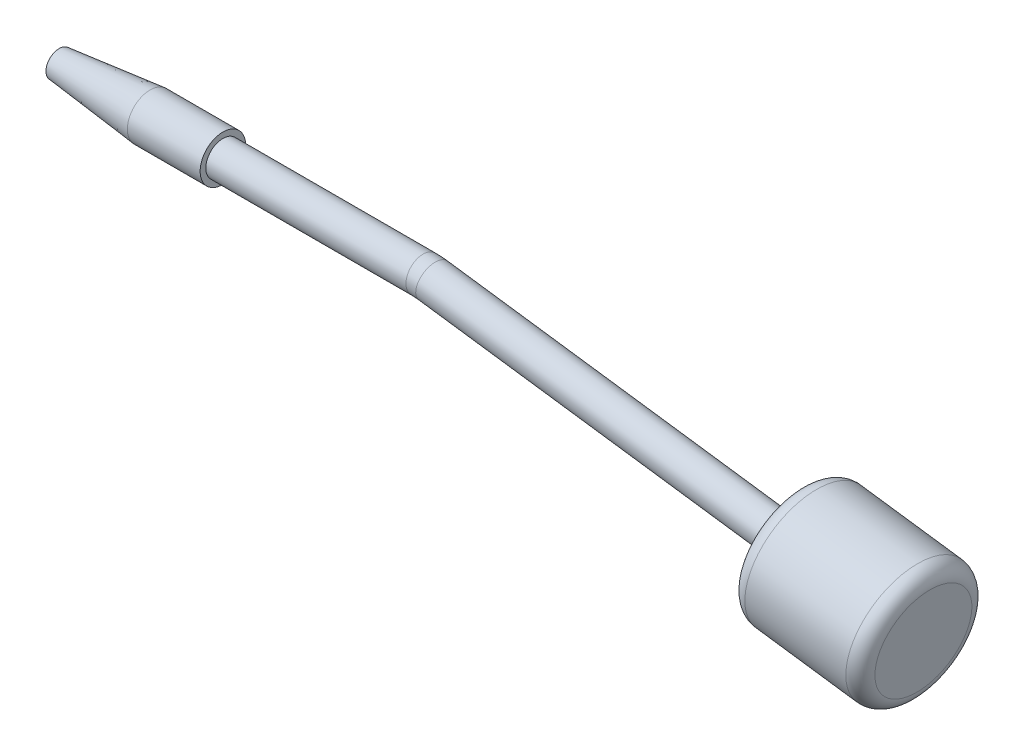
ISO-10303-21;
HEADER;
FILE_DESCRIPTION(('STEP AP214'),'2;1');
FILE_NAME('part.step','',(''),(''),'','','');
FILE_SCHEMA(('AUTOMOTIVE_DESIGN { 1 0 10303 214 1 1 1 1 }'));
ENDSEC;
DATA;
#1=APPLICATION_CONTEXT('core data for automotive mechanical design processes');
#2=APPLICATION_PROTOCOL_DEFINITION('international standard','automotive_design',2000,#1);
#3=PRODUCT_CONTEXT('',#1,'mechanical');
#4=PRODUCT('Part','Part','',(#3));
#5=PRODUCT_RELATED_PRODUCT_CATEGORY('part','',(#4));
#6=PRODUCT_DEFINITION_FORMATION('','',#4);
#7=PRODUCT_DEFINITION_CONTEXT('part definition',#1,'design');
#8=PRODUCT_DEFINITION('design','',#6,#7);
#9=PRODUCT_DEFINITION_SHAPE('','',#8);
#10=(LENGTH_UNIT() NAMED_UNIT(*) SI_UNIT(.MILLI.,.METRE.));
#11=(NAMED_UNIT(*) PLANE_ANGLE_UNIT() SI_UNIT($,.RADIAN.));
#12=(NAMED_UNIT(*) SI_UNIT($,.STERADIAN.) SOLID_ANGLE_UNIT());
#13=UNCERTAINTY_MEASURE_WITH_UNIT(LENGTH_MEASURE(1.E-05),#10,'distance_accuracy_value','');
#14=(GEOMETRIC_REPRESENTATION_CONTEXT(3) GLOBAL_UNCERTAINTY_ASSIGNED_CONTEXT((#13)) GLOBAL_UNIT_ASSIGNED_CONTEXT((#10,
#11,#12)) REPRESENTATION_CONTEXT('',''));
#15=CARTESIAN_POINT('',(0.,0.,0.));
#16=DIRECTION('',(0.,0.,1.));
#17=DIRECTION('',(1.,0.,0.));
#18=AXIS2_PLACEMENT_3D('',#15,#16,#17);
#19=CARTESIAN_POINT('',(0.,0.,0.));
#20=DIRECTION('',(1.,0.,0.));
#21=DIRECTION('',(0.,1.,0.));
#22=AXIS2_PLACEMENT_3D('',#19,#20,#21);
#23=CYLINDRICAL_SURFACE('',#22,3.96875);
#24=CARTESIAN_POINT('',(-34.925,0.,0.));
#25=DIRECTION('',(1.,0.,0.));
#26=DIRECTION('',(0.,1.,0.));
#27=AXIS2_PLACEMENT_3D('',#24,#25,#26);
#28=CIRCLE('',#27,3.96875);
#29=CARTESIAN_POINT('',(-34.925,3.96874999999999,0.));
#30=VERTEX_POINT('',#29);
#31=EDGE_CURVE('E62',#30,#30,#28,.T.);
#32=ORIENTED_EDGE('',*,*,#31,.F.);
#33=EDGE_LOOP('',(#32));
#34=FACE_BOUND('',#33,.T.);
#35=CARTESIAN_POINT('',(-47.625,0.,0.));
#36=DIRECTION('',(1.,0.,0.));
#37=DIRECTION('',(0.,1.,0.));
#38=AXIS2_PLACEMENT_3D('',#35,#36,#37);
#39=CIRCLE('',#38,3.96875);
#40=CARTESIAN_POINT('',(-47.625,3.96874999999999,0.));
#41=VERTEX_POINT('',#40);
#42=EDGE_CURVE('E75',#41,#41,#39,.T.);
#43=ORIENTED_EDGE('',*,*,#42,.T.);
#44=EDGE_LOOP('',(#43));
#45=FACE_BOUND('',#44,.T.);
#46=ADVANCED_FACE('F42',(#34,#45),#23,.T.);
#47=CARTESIAN_POINT('',(-34.925,-3.96875,0.));
#48=DIRECTION('',(-1.,0.,0.));
#49=DIRECTION('',(0.,-1.,0.));
#50=AXIS2_PLACEMENT_3D('',#47,#48,#49);
#51=PLANE('',#50);
#52=CARTESIAN_POINT('',(-34.925,0.,0.));
#53=DIRECTION('',(1.,0.,0.));
#54=DIRECTION('',(0.,1.,0.));
#55=AXIS2_PLACEMENT_3D('',#52,#53,#54);
#56=CIRCLE('',#55,2.98450000000002);
#57=CARTESIAN_POINT('',(-34.925,2.98450000000001,0.));
#58=VERTEX_POINT('',#57);
#59=EDGE_CURVE('E65',#58,#58,#56,.T.);
#60=ORIENTED_EDGE('',*,*,#59,.F.);
#61=EDGE_LOOP('',(#60));
#62=FACE_BOUND('',#61,.T.);
#63=ORIENTED_EDGE('',*,*,#31,.T.);
#64=EDGE_LOOP('',(#63));
#65=FACE_BOUND('',#64,.T.);
#66=ADVANCED_FACE('F111',(#62,#65),#51,.F.);
#67=CARTESIAN_POINT('',(0.,0.,0.));
#68=DIRECTION('',(1.,0.,0.));
#69=DIRECTION('',(0.,1.,0.));
#70=AXIS2_PLACEMENT_3D('',#67,#68,#69);
#71=CYLINDRICAL_SURFACE('',#70,2.98450000000002);
#72=CARTESIAN_POINT('',(0.,0.,0.));
#73=DIRECTION('',(1.,0.,0.));
#74=DIRECTION('',(0.,1.,0.));
#75=AXIS2_PLACEMENT_3D('',#72,#73,#74);
#76=CIRCLE('',#75,2.98450000000002);
#77=CARTESIAN_POINT('',(0.,2.9845,0.));
#78=VERTEX_POINT('',#77);
#79=EDGE_CURVE('E68',#78,#78,#76,.T.);
#80=ORIENTED_EDGE('',*,*,#79,.F.);
#81=EDGE_LOOP('',(#80));
#82=FACE_BOUND('',#81,.T.);
#83=ORIENTED_EDGE('',*,*,#59,.T.);
#84=EDGE_LOOP('',(#83));
#85=FACE_BOUND('',#84,.T.);
#86=ADVANCED_FACE('F117',(#82,#85),#71,.T.);
#87=CARTESIAN_POINT('',(0.,0.,0.));
#88=DIRECTION('',(1.,0.,0.));
#89=DIRECTION('',(0.,1.,0.));
#90=AXIS2_PLACEMENT_3D('',#87,#88,#89);
#91=CYLINDRICAL_SURFACE('',#90,0.793750000000017);
#92=CARTESIAN_POINT('',(-63.5,0.,0.));
#93=DIRECTION('',(1.,0.,0.));
#94=DIRECTION('',(0.,1.,0.));
#95=AXIS2_PLACEMENT_3D('',#92,#93,#94);
#96=CIRCLE('',#95,0.793750000000017);
#97=CARTESIAN_POINT('',(-63.5,0.793750000000009,0.));
#98=VERTEX_POINT('',#97);
#99=EDGE_CURVE('E71',#98,#98,#96,.T.);
#100=ORIENTED_EDGE('',*,*,#99,.F.);
#101=EDGE_LOOP('',(#100));
#102=FACE_BOUND('',#101,.T.);
#103=CARTESIAN_POINT('',(0.,0.,0.));
#104=DIRECTION('',(1.,0.,0.));
#105=DIRECTION('',(0.,1.,0.));
#106=AXIS2_PLACEMENT_3D('',#103,#104,#105);
#107=CIRCLE('',#106,0.793750000000018);
#108=CARTESIAN_POINT('',(0.,0.793750000000018,0.));
#109=VERTEX_POINT('',#108);
#110=EDGE_CURVE('E72',#109,#109,#107,.T.);
#111=ORIENTED_EDGE('',*,*,#110,.T.);
#112=EDGE_LOOP('',(#111));
#113=FACE_BOUND('',#112,.T.);
#114=ADVANCED_FACE('F199',(#102,#113),#91,.F.);
#115=CARTESIAN_POINT('',(-63.5,-0.793750000000025,0.));
#116=DIRECTION('',(1.,0.,0.));
#117=DIRECTION('',(0.,1.,0.));
#118=AXIS2_PLACEMENT_3D('',#115,#116,#117);
#119=PLANE('',#118);
#120=CARTESIAN_POINT('',(-63.5,0.,0.));
#121=DIRECTION('',(1.,0.,0.));
#122=DIRECTION('',(0.,1.,0.));
#123=AXIS2_PLACEMENT_3D('',#120,#121,#122);
#124=CIRCLE('',#123,2.286);
#125=CARTESIAN_POINT('',(-63.5,2.28599999999999,0.));
#126=VERTEX_POINT('',#125);
#127=EDGE_CURVE('E79',#126,#126,#124,.T.);
#128=ORIENTED_EDGE('',*,*,#127,.F.);
#129=EDGE_LOOP('',(#128));
#130=FACE_BOUND('',#129,.T.);
#131=ORIENTED_EDGE('',*,*,#99,.T.);
#132=EDGE_LOOP('',(#131));
#133=FACE_BOUND('',#132,.T.);
#134=ADVANCED_FACE('F190',(#130,#133),#119,.F.);
#135=CARTESIAN_POINT('',(-63.5,0.,0.));
#136=DIRECTION('',(1.,0.,0.));
#137=DIRECTION('',(0.,1.,0.));
#138=AXIS2_PLACEMENT_3D('',#135,#136,#137);
#139=CONICAL_SURFACE('',#138,2.286,0.1056056498234);
#140=ORIENTED_EDGE('',*,*,#42,.F.);
#141=EDGE_LOOP('',(#140));
#142=FACE_BOUND('',#141,.T.);
#143=ORIENTED_EDGE('',*,*,#127,.T.);
#144=EDGE_LOOP('',(#143));
#145=FACE_BOUND('',#144,.T.);
#146=ADVANCED_FACE('F108',(#142,#145),#139,.T.);
#147=CARTESIAN_POINT('',(0.,0.,0.));
#148=DIRECTION('',(-1.,0.,0.));
#149=DIRECTION('',(0.,-1.,0.));
#150=AXIS2_PLACEMENT_3D('',#147,#148,#149);
#151=PLANE('',#150);
#152=ORIENTED_EDGE('',*,*,#110,.F.);
#153=EDGE_LOOP('',(#152));
#154=FACE_BOUND('',#153,.T.);
#155=ADVANCED_FACE('F98',(#154),#151,.T.);
#156=CARTESIAN_POINT('',(0.,-12.7,0.));
#157=DIRECTION('',(0.,0.,-1.));
#158=DIRECTION('',(-1.,0.,0.));
#159=AXIS2_PLACEMENT_3D('',#156,#157,#158);
#160=TOROIDAL_SURFACE('',#159,12.7,2.9845);
#161=CARTESIAN_POINT('',(1.72358776991566,-0.117502426012672,0.));
#162=DIRECTION('',(-0.990747840471443,0.135715572434305,0.));
#163=DIRECTION('',(-0.135715572434305,-0.990747840471443,0.));
#164=AXIS2_PLACEMENT_3D('',#161,#162,#163);
#165=CIRCLE('',#164,2.9845);
#166=CARTESIAN_POINT('',(2.12863089584584,2.83938450387436,0.));
#167=VERTEX_POINT('',#166);
#168=EDGE_CURVE('E76',#167,#167,#165,.T.);
#169=CARTESIAN_POINT('',(0.,-12.7,0.));
#170=DIRECTION('',(0.,0.,-1.));
#171=DIRECTION('',(-1.,0.,0.));
#172=AXIS2_PLACEMENT_3D('',#169,#170,#171);
#173=CIRCLE('',#172,15.6845);
#174=EDGE_CURVE('',#78,#167,#173,.T.);
#175=ORIENTED_EDGE('',*,*,#79,.T.);
#176=ORIENTED_EDGE('',*,*,#168,.T.);
#177=ORIENTED_EDGE('',*,*,#174,.T.);
#178=ORIENTED_EDGE('',*,*,#174,.F.);
#179=EDGE_LOOP('',(#175,#177,#176,#178));
#180=FACE_BOUND('',#179,.T.);
#181=ADVANCED_FACE('F90',(#180),#160,.T.);
#182=CARTESIAN_POINT('',(1.72358776991567,-0.11750242601267,0.));
#183=DIRECTION('',(0.990747840471443,-0.135715572434305,0.));
#184=DIRECTION('',(0.135715572434305,0.990747840471444,0.));
#185=AXIS2_PLACEMENT_3D('',#182,#183,#184);
#186=CYLINDRICAL_SURFACE('',#185,2.9845);
#187=CARTESIAN_POINT('',(64.6360756398523,-8.73544127559105,0.));
#188=DIRECTION('',(-0.990747840471443,0.135715572434305,0.));
#189=DIRECTION('',(-0.135715572434305,-0.990747840471443,0.));
#190=AXIS2_PLACEMENT_3D('',#187,#188,#189);
#191=CIRCLE('',#190,2.9845);
#192=CARTESIAN_POINT('',(64.2310325139221,-11.6923282054781,0.));
#193=VERTEX_POINT('',#192);
#194=EDGE_CURVE('E84',#193,#193,#191,.T.);
#195=ORIENTED_EDGE('',*,*,#194,.T.);
#196=EDGE_LOOP('',(#195));
#197=FACE_BOUND('',#196,.T.);
#198=ORIENTED_EDGE('',*,*,#168,.F.);
#199=EDGE_LOOP('',(#198));
#200=FACE_BOUND('',#199,.T.);
#201=ADVANCED_FACE('F93',(#197,#200),#186,.T.);
#202=CARTESIAN_POINT('',(87.2845712730295,-11.8378992614393,0.));
#203=DIRECTION('',(0.990747840471443,-0.135715572434305,0.));
#204=DIRECTION('',(0.135715572434305,0.990747840471443,0.));
#205=AXIS2_PLACEMENT_3D('',#202,#203,#204);
#206=PLANE('',#205);
#207=CARTESIAN_POINT('',(87.2845712730295,-11.8378992614393,0.));
#208=DIRECTION('',(0.990747840471443,-0.135715572434305,0.));
#209=DIRECTION('',(0.135715572434305,0.990747840471443,0.));
#210=AXIS2_PLACEMENT_3D('',#207,#208,#209);
#211=CIRCLE('',#210,8.382);
#212=CARTESIAN_POINT('',(88.4221392011739,-3.53345086260763,0.));
#213=VERTEX_POINT('',#212);
#214=EDGE_CURVE('E49',#213,#213,#211,.T.);
#215=ORIENTED_EDGE('',*,*,#214,.T.);
#216=EDGE_LOOP('',(#215));
#217=FACE_BOUND('',#216,.T.);
#218=ADVANCED_FACE('F95',(#217),#206,.T.);
#219=CARTESIAN_POINT('',(64.6360756398523,-8.73544127559105,0.));
#220=DIRECTION('',(-0.990747840471443,0.135715572434305,0.));
#221=DIRECTION('',(-0.135715572434305,-0.990747840471443,0.));
#222=AXIS2_PLACEMENT_3D('',#219,#220,#221);
#223=CYLINDRICAL_SURFACE('',#222,10.922);
#224=CARTESIAN_POINT('',(84.7680717582321,-11.4931817074561,0.));
#225=DIRECTION('',(0.990747840471443,-0.135715572434305,0.));
#226=DIRECTION('',(0.135715572434305,0.990747840471443,0.));
#227=AXIS2_PLACEMENT_3D('',#224,#225,#226);
#228=CIRCLE('',#227,10.922);
#229=CARTESIAN_POINT('',(86.2503572403595,-0.672233793827028,0.));
#230=VERTEX_POINT('',#229);
#231=EDGE_CURVE('E53',#230,#230,#228,.F.);
#232=ORIENTED_EDGE('',*,*,#231,.T.);
#233=EDGE_LOOP('',(#232));
#234=FACE_BOUND('',#233,.T.);
#235=CARTESIAN_POINT('',(67.1525751546498,-9.08015882957418,0.));
#236=DIRECTION('',(-0.990747840471443,0.135715572434305,0.));
#237=DIRECTION('',(-0.135715572434305,-0.990747840471443,0.));
#238=AXIS2_PLACEMENT_3D('',#235,#236,#237);
#239=CIRCLE('',#238,10.922);
#240=CARTESIAN_POINT('',(65.6702896725223,-19.9011067432033,0.));
#241=VERTEX_POINT('',#240);
#242=EDGE_CURVE('E57',#241,#241,#239,.F.);
#243=ORIENTED_EDGE('',*,*,#242,.T.);
#244=EDGE_LOOP('',(#243));
#245=FACE_BOUND('',#244,.T.);
#246=ADVANCED_FACE('F103',(#234,#245),#223,.T.);
#247=CARTESIAN_POINT('',(63.1537901577248,-19.5563891892202,0.));
#248=DIRECTION('',(-0.990747840471443,0.135715572434305,0.));
#249=DIRECTION('',(-0.135715572434305,-0.990747840471443,0.));
#250=AXIS2_PLACEMENT_3D('',#247,#248,#249);
#251=PLANE('',#250);
#252=CARTESIAN_POINT('',(64.6360756398523,-8.73544127559105,0.));
#253=DIRECTION('',(-0.990747840471443,0.135715572434305,0.));
#254=DIRECTION('',(-0.135715572434305,-0.990747840471443,0.));
#255=AXIS2_PLACEMENT_3D('',#252,#253,#254);
#256=CIRCLE('',#255,8.382);
#257=CARTESIAN_POINT('',(63.498507711708,-17.0398896744227,0.));
#258=VERTEX_POINT('',#257);
#259=EDGE_CURVE('E11',#258,#258,#256,.T.);
#260=ORIENTED_EDGE('',*,*,#259,.T.);
#261=EDGE_LOOP('',(#260));
#262=FACE_BOUND('',#261,.T.);
#263=ORIENTED_EDGE('',*,*,#194,.F.);
#264=EDGE_LOOP('',(#263));
#265=FACE_BOUND('',#264,.T.);
#266=ADVANCED_FACE('F125',(#262,#265),#251,.T.);
#267=CARTESIAN_POINT('',(84.7680717582321,-11.4931817074561,0.));
#268=DIRECTION('',(0.990747840471443,-0.135715572434305,0.));
#269=DIRECTION('',(0.135715572434305,0.990747840471443,0.));
#270=AXIS2_PLACEMENT_3D('',#267,#268,#269);
#271=TOROIDAL_SURFACE('',#270,8.382,2.54);
#272=ORIENTED_EDGE('',*,*,#214,.F.);
#273=EDGE_LOOP('',(#272));
#274=FACE_BOUND('',#273,.T.);
#275=ORIENTED_EDGE('',*,*,#231,.F.);
#276=EDGE_LOOP('',(#275));
#277=FACE_BOUND('',#276,.T.);
#278=ADVANCED_FACE('F123',(#274,#277),#271,.T.);
#279=CARTESIAN_POINT('',(67.1525751546498,-9.08015882957418,0.));
#280=DIRECTION('',(-0.990747840471443,0.135715572434305,0.));
#281=DIRECTION('',(-0.135715572434305,-0.990747840471443,0.));
#282=AXIS2_PLACEMENT_3D('',#279,#280,#281);
#283=TOROIDAL_SURFACE('',#282,8.382,2.54);
#284=ORIENTED_EDGE('',*,*,#242,.F.);
#285=EDGE_LOOP('',(#284));
#286=FACE_BOUND('',#285,.T.);
#287=ORIENTED_EDGE('',*,*,#259,.F.);
#288=EDGE_LOOP('',(#287));
#289=FACE_BOUND('',#288,.T.);
#290=ADVANCED_FACE('F44',(#286,#289),#283,.T.);
#291=CLOSED_SHELL('',(#46,#66,#86,#114,#134,#146,#155,#181,#201,#218,#246,#266,#278,#290));
#292=MANIFOLD_SOLID_BREP('B2',#291);
#293=ADVANCED_BREP_SHAPE_REPRESENTATION('',(#18,#292),#14);
#294=SHAPE_DEFINITION_REPRESENTATION(#9,#293);
ENDSEC;
END-ISO-10303-21;
